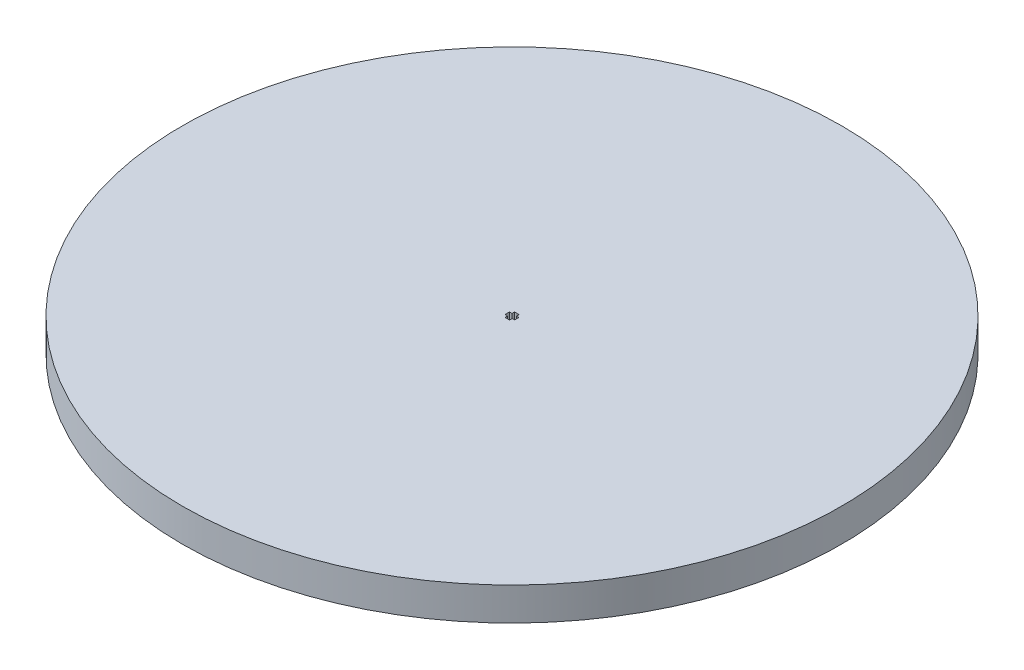
ISO-10303-21;
HEADER;
FILE_DESCRIPTION(('STEP AP214'),'2;1');
FILE_NAME('part.step','',(''),(''),'','','');
FILE_SCHEMA(('AUTOMOTIVE_DESIGN { 1 0 10303 214 1 1 1 1 }'));
ENDSEC;
DATA;
#1=APPLICATION_CONTEXT('core data for automotive mechanical design processes');
#2=APPLICATION_PROTOCOL_DEFINITION('international standard','automotive_design',2000,#1);
#3=PRODUCT_CONTEXT('',#1,'mechanical');
#4=PRODUCT('Part','Part','',(#3));
#5=PRODUCT_RELATED_PRODUCT_CATEGORY('part','',(#4));
#6=PRODUCT_DEFINITION_FORMATION('','',#4);
#7=PRODUCT_DEFINITION_CONTEXT('part definition',#1,'design');
#8=PRODUCT_DEFINITION('design','',#6,#7);
#9=PRODUCT_DEFINITION_SHAPE('','',#8);
#10=(LENGTH_UNIT() NAMED_UNIT(*) SI_UNIT(.MILLI.,.METRE.));
#11=(NAMED_UNIT(*) PLANE_ANGLE_UNIT() SI_UNIT($,.RADIAN.));
#12=(NAMED_UNIT(*) SI_UNIT($,.STERADIAN.) SOLID_ANGLE_UNIT());
#13=UNCERTAINTY_MEASURE_WITH_UNIT(LENGTH_MEASURE(1.E-05),#10,'distance_accuracy_value','');
#14=(GEOMETRIC_REPRESENTATION_CONTEXT(3) GLOBAL_UNCERTAINTY_ASSIGNED_CONTEXT((#13)) GLOBAL_UNIT_ASSIGNED_CONTEXT((#10,
#11,#12)) REPRESENTATION_CONTEXT('',''));
#15=CARTESIAN_POINT('',(0.,0.,0.));
#16=DIRECTION('',(0.,0.,1.));
#17=DIRECTION('',(1.,0.,0.));
#18=AXIS2_PLACEMENT_3D('',#15,#16,#17);
#19=CARTESIAN_POINT('',(0.0113900111349613,5.,0.337884099115303));
#20=DIRECTION('',(-0.0336906801634146,0.,-0.999432307897902));
#21=DIRECTION('',(-0.999432307897902,0.,0.0336906801634146));
#22=AXIS2_PLACEMENT_3D('',#19,#20,#21);
#23=PLANE('',#22);
#24=DIRECTION('',(0.999432307897902,0.,-0.0336906801634146));
#25=VECTOR('',#24,1.);
#26=CARTESIAN_POINT('',(0.0113900111349613,0.,0.337884099115303));
#27=LINE('',#26,#25);
#28=CARTESIAN_POINT('',(0.349274110250247,0.,0.326494087980342));
#29=VERTEX_POINT('',#28);
#30=CARTESIAN_POINT('',(0.732860344614081,0.,0.313563466231459));
#31=VERTEX_POINT('',#30);
#32=EDGE_CURVE('E175',#29,#31,#27,.T.);
#33=ORIENTED_EDGE('',*,*,#32,.F.);
#34=DIRECTION('',(0.,-1.,0.));
#35=VECTOR('',#34,1.);
#36=CARTESIAN_POINT('',(0.349274110250247,5.,0.326494087980342));
#37=LINE('',#36,#35);
#38=CARTESIAN_POINT('',(0.349274110250247,5.,0.326494087980342));
#39=VERTEX_POINT('',#38);
#40=EDGE_CURVE('E11',#39,#29,#37,.T.);
#41=ORIENTED_EDGE('',*,*,#40,.F.);
#42=DIRECTION('',(0.999432307897902,0.,-0.0336906801634146));
#43=VECTOR('',#42,1.);
#44=CARTESIAN_POINT('',(0.0113900111349613,5.,0.337884099115303));
#45=LINE('',#44,#43);
#46=CARTESIAN_POINT('',(0.732860344614081,5.,0.313563466231459));
#47=VERTEX_POINT('',#46);
#48=EDGE_CURVE('E214',#39,#47,#45,.T.);
#49=ORIENTED_EDGE('',*,*,#48,.T.);
#50=DIRECTION('',(0.,-1.,0.));
#51=VECTOR('',#50,1.);
#52=CARTESIAN_POINT('',(0.732860344614081,5.,0.313563466231459));
#53=LINE('',#52,#51);
#54=EDGE_CURVE('E51',#47,#31,#53,.T.);
#55=ORIENTED_EDGE('',*,*,#54,.T.);
#56=EDGE_LOOP('',(#33,#41,#49,#55));
#57=FACE_BOUND('',#56,.T.);
#58=ADVANCED_FACE('F35',(#57),#23,.T.);
#59=CARTESIAN_POINT('',(0.337884099115299,5.,-0.0113900111349488));
#60=DIRECTION('',(0.999432307897903,0.,-0.033690680163378));
#61=DIRECTION('',(-0.033690680163378,0.,-0.999432307897903));
#62=AXIS2_PLACEMENT_3D('',#59,#60,#61);
#63=PLANE('',#62);
#64=DIRECTION('',(0.033690680163378,0.,0.999432307897903));
#65=VECTOR('',#64,1.);
#66=CARTESIAN_POINT('',(0.337884099115299,0.,-0.0113900111349488));
#67=LINE('',#66,#65);
#68=CARTESIAN_POINT('',(0.362204731999116,0.,0.710080322344181));
#69=VERTEX_POINT('',#68);
#70=EDGE_CURVE('E177',#29,#69,#67,.T.);
#71=ORIENTED_EDGE('',*,*,#70,.T.);
#72=DIRECTION('',(0.,-1.,0.));
#73=VECTOR('',#72,1.);
#74=CARTESIAN_POINT('',(0.362204731999116,5.,0.710080322344181));
#75=LINE('',#74,#73);
#76=CARTESIAN_POINT('',(0.362204731999116,5.,0.710080322344181));
#77=VERTEX_POINT('',#76);
#78=EDGE_CURVE('E43',#77,#69,#75,.T.);
#79=ORIENTED_EDGE('',*,*,#78,.F.);
#80=DIRECTION('',(0.033690680163378,0.,0.999432307897903));
#81=VECTOR('',#80,1.);
#82=CARTESIAN_POINT('',(0.337884099115299,5.,-0.0113900111349488));
#83=LINE('',#82,#81);
#84=EDGE_CURVE('E265',#39,#77,#83,.T.);
#85=ORIENTED_EDGE('',*,*,#84,.F.);
#86=ORIENTED_EDGE('',*,*,#40,.T.);
#87=EDGE_LOOP('',(#71,#79,#85,#86));
#88=FACE_BOUND('',#87,.T.);
#89=ADVANCED_FACE('F295',(#88),#63,.F.);
#90=CARTESIAN_POINT('',(0.0243206328838019,5.,0.721470333479124));
#91=DIRECTION('',(0.0336906801633572,0.,0.999432307897904));
#92=DIRECTION('',(0.999432307897904,0.,-0.0336906801633572));
#93=AXIS2_PLACEMENT_3D('',#90,#91,#92);
#94=PLANE('',#93);
#95=DIRECTION('',(-0.999432307897904,0.,0.0336906801633572));
#96=VECTOR('',#95,1.);
#97=CARTESIAN_POINT('',(0.0243206328838019,0.,0.721470333479124));
#98=LINE('',#97,#96);
#99=CARTESIAN_POINT('',(0.0121637690797267,0.,0.721880139132769));
#100=VERTEX_POINT('',#99);
#101=EDGE_CURVE('E179',#69,#100,#98,.T.);
#102=ORIENTED_EDGE('',*,*,#101,.T.);
#103=DIRECTION('',(0.,-1.,0.));
#104=VECTOR('',#103,1.);
#105=CARTESIAN_POINT('',(0.0121637690797267,5.,0.721880139132769));
#106=LINE('',#105,#104);
#107=CARTESIAN_POINT('',(0.0121637690797267,5.,0.721880139132769));
#108=VERTEX_POINT('',#107);
#109=EDGE_CURVE('E237',#108,#100,#106,.T.);
#110=ORIENTED_EDGE('',*,*,#109,.F.);
#111=DIRECTION('',(-0.999432307897904,0.,0.0336906801633572));
#112=VECTOR('',#111,1.);
#113=CARTESIAN_POINT('',(0.0243206328838019,5.,0.721470333479124));
#114=LINE('',#113,#112);
#115=EDGE_CURVE('E245',#77,#108,#114,.T.);
#116=ORIENTED_EDGE('',*,*,#115,.F.);
#117=ORIENTED_EDGE('',*,*,#78,.T.);
#118=EDGE_LOOP('',(#102,#110,#116,#117));
#119=FACE_BOUND('',#118,.T.);
#120=ADVANCED_FACE('F243',(#119),#94,.F.);
#121=CARTESIAN_POINT('',(0.,5.,0.721880139132769));
#122=DIRECTION('',(0.,0.,-1.));
#123=DIRECTION('',(-1.,0.,0.));
#124=AXIS2_PLACEMENT_3D('',#121,#122,#123);
#125=PLANE('',#124);
#126=DIRECTION('',(1.,0.,0.));
#127=VECTOR('',#126,1.);
#128=CARTESIAN_POINT('',(0.,0.,0.721880139132769));
#129=LINE('',#128,#127);
#130=CARTESIAN_POINT('',(-0.338076022203014,0.,0.721880139132769));
#131=VERTEX_POINT('',#130);
#132=EDGE_CURVE('E182',#131,#100,#129,.T.);
#133=ORIENTED_EDGE('',*,*,#132,.F.);
#134=DIRECTION('',(0.,-1.,0.));
#135=VECTOR('',#134,1.);
#136=CARTESIAN_POINT('',(-0.338076022203014,5.,0.721880139132769));
#137=LINE('',#136,#135);
#138=CARTESIAN_POINT('',(-0.338076022203014,5.,0.721880139132769));
#139=VERTEX_POINT('',#138);
#140=EDGE_CURVE('E235',#139,#131,#137,.T.);
#141=ORIENTED_EDGE('',*,*,#140,.F.);
#142=DIRECTION('',(1.,0.,0.));
#143=VECTOR('',#142,1.);
#144=CARTESIAN_POINT('',(0.,5.,0.721880139132769));
#145=LINE('',#144,#143);
#146=EDGE_CURVE('E259',#139,#108,#145,.T.);
#147=ORIENTED_EDGE('',*,*,#146,.T.);
#148=ORIENTED_EDGE('',*,*,#109,.T.);
#149=EDGE_LOOP('',(#133,#141,#147,#148));
#150=FACE_BOUND('',#149,.T.);
#151=ADVANCED_FACE('F255',(#150),#125,.T.);
#152=CARTESIAN_POINT('',(-0.338076022203014,5.,0.));
#153=DIRECTION('',(-1.,0.,0.));
#154=DIRECTION('',(0.,0.,1.));
#155=AXIS2_PLACEMENT_3D('',#152,#153,#154);
#156=PLANE('',#155);
#157=DIRECTION('',(0.,0.,-1.));
#158=VECTOR('',#157,1.);
#159=CARTESIAN_POINT('',(-0.338076022203014,0.,0.));
#160=LINE('',#159,#158);
#161=CARTESIAN_POINT('',(-0.338076022203014,0.,0.338076022203007));
#162=VERTEX_POINT('',#161);
#163=EDGE_CURVE('E185',#131,#162,#160,.T.);
#164=ORIENTED_EDGE('',*,*,#163,.T.);
#165=DIRECTION('',(0.,-1.,0.));
#166=VECTOR('',#165,1.);
#167=CARTESIAN_POINT('',(-0.338076022203014,5.,0.338076022203007));
#168=LINE('',#167,#166);
#169=CARTESIAN_POINT('',(-0.338076022203014,5.,0.338076022203007));
#170=VERTEX_POINT('',#169);
#171=EDGE_CURVE('E232',#170,#162,#168,.T.);
#172=ORIENTED_EDGE('',*,*,#171,.F.);
#173=DIRECTION('',(0.,0.,-1.));
#174=VECTOR('',#173,1.);
#175=CARTESIAN_POINT('',(-0.338076022203014,5.,0.));
#176=LINE('',#175,#174);
#177=EDGE_CURVE('E260',#139,#170,#176,.T.);
#178=ORIENTED_EDGE('',*,*,#177,.F.);
#179=ORIENTED_EDGE('',*,*,#140,.T.);
#180=EDGE_LOOP('',(#164,#172,#178,#179));
#181=FACE_BOUND('',#180,.T.);
#182=ADVANCED_FACE('F306',(#181),#156,.F.);
#183=CARTESIAN_POINT('',(0.,5.,0.338076022203017));
#184=DIRECTION('',(0.,0.,1.));
#185=DIRECTION('',(1.,0.,0.));
#186=AXIS2_PLACEMENT_3D('',#183,#184,#185);
#187=PLANE('',#186);
#188=DIRECTION('',(-1.,0.,0.));
#189=VECTOR('',#188,1.);
#190=CARTESIAN_POINT('',(0.,0.,0.338076022203017));
#191=LINE('',#190,#189);
#192=CARTESIAN_POINT('',(-0.72188013913278,0.,0.338076022202996));
#193=VERTEX_POINT('',#192);
#194=EDGE_CURVE('E187',#162,#193,#191,.T.);
#195=ORIENTED_EDGE('',*,*,#194,.T.);
#196=DIRECTION('',(0.,-1.,0.));
#197=VECTOR('',#196,1.);
#198=CARTESIAN_POINT('',(-0.72188013913278,5.,0.338076022202996));
#199=LINE('',#198,#197);
#200=CARTESIAN_POINT('',(-0.72188013913278,5.,0.338076022202996));
#201=VERTEX_POINT('',#200);
#202=EDGE_CURVE('E229',#201,#193,#199,.T.);
#203=ORIENTED_EDGE('',*,*,#202,.F.);
#204=DIRECTION('',(-1.,0.,0.));
#205=VECTOR('',#204,1.);
#206=CARTESIAN_POINT('',(0.,5.,0.338076022203017));
#207=LINE('',#206,#205);
#208=EDGE_CURVE('E262',#170,#201,#207,.T.);
#209=ORIENTED_EDGE('',*,*,#208,.F.);
#210=ORIENTED_EDGE('',*,*,#171,.T.);
#211=EDGE_LOOP('',(#195,#203,#209,#210));
#212=FACE_BOUND('',#211,.T.);
#213=ADVANCED_FACE('F307',(#212),#187,.F.);
#214=CARTESIAN_POINT('',(-0.721880139132775,5.,0.));
#215=DIRECTION('',(-1.,0.,0.));
#216=DIRECTION('',(0.,0.,1.));
#217=AXIS2_PLACEMENT_3D('',#214,#215,#216);
#218=PLANE('',#217);
#219=DIRECTION('',(0.,0.,-1.));
#220=VECTOR('',#219,1.);
#221=CARTESIAN_POINT('',(-0.721880139132775,0.,0.));
#222=LINE('',#221,#220);
#223=CARTESIAN_POINT('',(-0.72188013913278,0.,-0.338076022202996));
#224=VERTEX_POINT('',#223);
#225=EDGE_CURVE('E190',#193,#224,#222,.T.);
#226=ORIENTED_EDGE('',*,*,#225,.T.);
#227=DIRECTION('',(0.,-1.,0.));
#228=VECTOR('',#227,1.);
#229=CARTESIAN_POINT('',(-0.72188013913278,5.,-0.338076022202996));
#230=LINE('',#229,#228);
#231=CARTESIAN_POINT('',(-0.72188013913278,5.,-0.338076022202996));
#232=VERTEX_POINT('',#231);
#233=EDGE_CURVE('E227',#232,#224,#230,.T.);
#234=ORIENTED_EDGE('',*,*,#233,.F.);
#235=DIRECTION('',(0.,0.,-1.));
#236=VECTOR('',#235,1.);
#237=CARTESIAN_POINT('',(-0.721880139132775,5.,0.));
#238=LINE('',#237,#236);
#239=EDGE_CURVE('E270',#201,#232,#238,.T.);
#240=ORIENTED_EDGE('',*,*,#239,.F.);
#241=ORIENTED_EDGE('',*,*,#202,.T.);
#242=EDGE_LOOP('',(#226,#234,#240,#241));
#243=FACE_BOUND('',#242,.T.);
#244=ADVANCED_FACE('F310',(#243),#218,.F.);
#245=CARTESIAN_POINT('',(0.,5.,-0.338076022203017));
#246=DIRECTION('',(0.,0.,1.));
#247=DIRECTION('',(1.,0.,0.));
#248=AXIS2_PLACEMENT_3D('',#245,#246,#247);
#249=PLANE('',#248);
#250=DIRECTION('',(-1.,0.,0.));
#251=VECTOR('',#250,1.);
#252=CARTESIAN_POINT('',(0.,0.,-0.338076022203017));
#253=LINE('',#252,#251);
#254=CARTESIAN_POINT('',(-0.338076022203014,0.,-0.338076022203007));
#255=VERTEX_POINT('',#254);
#256=EDGE_CURVE('E193',#255,#224,#253,.T.);
#257=ORIENTED_EDGE('',*,*,#256,.F.);
#258=DIRECTION('',(0.,-1.,0.));
#259=VECTOR('',#258,1.);
#260=CARTESIAN_POINT('',(-0.338076022203014,5.,-0.338076022203007));
#261=LINE('',#260,#259);
#262=CARTESIAN_POINT('',(-0.338076022203014,5.,-0.338076022203007));
#263=VERTEX_POINT('',#262);
#264=EDGE_CURVE('E225',#263,#255,#261,.T.);
#265=ORIENTED_EDGE('',*,*,#264,.F.);
#266=DIRECTION('',(-1.,0.,0.));
#267=VECTOR('',#266,1.);
#268=CARTESIAN_POINT('',(0.,5.,-0.338076022203017));
#269=LINE('',#268,#267);
#270=EDGE_CURVE('E272',#263,#232,#269,.T.);
#271=ORIENTED_EDGE('',*,*,#270,.T.);
#272=ORIENTED_EDGE('',*,*,#233,.T.);
#273=EDGE_LOOP('',(#257,#265,#271,#272));
#274=FACE_BOUND('',#273,.T.);
#275=ADVANCED_FACE('F314',(#274),#249,.T.);
#276=CARTESIAN_POINT('',(-0.338076022203014,0.,-0.721880139132769));
#277=VERTEX_POINT('',#276);
#278=EDGE_CURVE('E188',#255,#277,#160,.T.);
#279=ORIENTED_EDGE('',*,*,#278,.T.);
#280=DIRECTION('',(0.,-1.,0.));
#281=VECTOR('',#280,1.);
#282=CARTESIAN_POINT('',(-0.338076022203014,5.,-0.721880139132769));
#283=LINE('',#282,#281);
#284=CARTESIAN_POINT('',(-0.338076022203014,5.,-0.721880139132769));
#285=VERTEX_POINT('',#284);
#286=EDGE_CURVE('E222',#285,#277,#283,.T.);
#287=ORIENTED_EDGE('',*,*,#286,.F.);
#288=EDGE_CURVE('E264',#263,#285,#176,.T.);
#289=ORIENTED_EDGE('',*,*,#288,.F.);
#290=ORIENTED_EDGE('',*,*,#264,.T.);
#291=EDGE_LOOP('',(#279,#287,#289,#290));
#292=FACE_BOUND('',#291,.T.);
#293=ADVANCED_FACE('F318',(#292),#156,.F.);
#294=CARTESIAN_POINT('',(0.,5.,-0.721880139132769));
#295=DIRECTION('',(0.,0.,-1.));
#296=DIRECTION('',(-1.,0.,0.));
#297=AXIS2_PLACEMENT_3D('',#294,#295,#296);
#298=PLANE('',#297);
#299=DIRECTION('',(1.,0.,0.));
#300=VECTOR('',#299,1.);
#301=CARTESIAN_POINT('',(0.,0.,-0.721880139132769));
#302=LINE('',#301,#300);
#303=CARTESIAN_POINT('',(0.0121637690797267,0.,-0.721880139132769));
#304=VERTEX_POINT('',#303);
#305=EDGE_CURVE('E196',#277,#304,#302,.T.);
#306=ORIENTED_EDGE('',*,*,#305,.T.);
#307=DIRECTION('',(0.,-1.,0.));
#308=VECTOR('',#307,1.);
#309=CARTESIAN_POINT('',(0.0121637690797267,5.,-0.721880139132769));
#310=LINE('',#309,#308);
#311=CARTESIAN_POINT('',(0.0121637690797267,5.,-0.721880139132769));
#312=VERTEX_POINT('',#311);
#313=EDGE_CURVE('E220',#312,#304,#310,.T.);
#314=ORIENTED_EDGE('',*,*,#313,.F.);
#315=DIRECTION('',(1.,0.,0.));
#316=VECTOR('',#315,1.);
#317=CARTESIAN_POINT('',(0.,5.,-0.721880139132769));
#318=LINE('',#317,#316);
#319=EDGE_CURVE('E275',#285,#312,#318,.T.);
#320=ORIENTED_EDGE('',*,*,#319,.F.);
#321=ORIENTED_EDGE('',*,*,#286,.T.);
#322=EDGE_LOOP('',(#306,#314,#320,#321));
#323=FACE_BOUND('',#322,.T.);
#324=ADVANCED_FACE('F322',(#323),#298,.F.);
#325=CARTESIAN_POINT('',(0.0243206328838019,5.,-0.721470333479124));
#326=DIRECTION('',(-0.0336906801633572,0.,0.999432307897904));
#327=DIRECTION('',(0.999432307897904,0.,0.0336906801633572));
#328=AXIS2_PLACEMENT_3D('',#325,#326,#327);
#329=PLANE('',#328);
#330=DIRECTION('',(-0.999432307897904,0.,-0.0336906801633572));
#331=VECTOR('',#330,1.);
#332=CARTESIAN_POINT('',(0.0243206328838019,0.,-0.721470333479124));
#333=LINE('',#332,#331);
#334=CARTESIAN_POINT('',(0.362204731999116,0.,-0.710080322344181));
#335=VERTEX_POINT('',#334);
#336=EDGE_CURVE('E199',#335,#304,#333,.T.);
#337=ORIENTED_EDGE('',*,*,#336,.F.);
#338=DIRECTION('',(0.,-1.,0.));
#339=VECTOR('',#338,1.);
#340=CARTESIAN_POINT('',(0.362204731999116,5.,-0.710080322344181));
#341=LINE('',#340,#339);
#342=CARTESIAN_POINT('',(0.362204731999116,5.,-0.710080322344181));
#343=VERTEX_POINT('',#342);
#344=EDGE_CURVE('E218',#343,#335,#341,.T.);
#345=ORIENTED_EDGE('',*,*,#344,.F.);
#346=DIRECTION('',(-0.999432307897904,0.,-0.0336906801633572));
#347=VECTOR('',#346,1.);
#348=CARTESIAN_POINT('',(0.0243206328838019,5.,-0.721470333479124));
#349=LINE('',#348,#347);
#350=EDGE_CURVE('E277',#343,#312,#349,.T.);
#351=ORIENTED_EDGE('',*,*,#350,.T.);
#352=ORIENTED_EDGE('',*,*,#313,.T.);
#353=EDGE_LOOP('',(#337,#345,#351,#352));
#354=FACE_BOUND('',#353,.T.);
#355=ADVANCED_FACE('F326',(#354),#329,.T.);
#356=CARTESIAN_POINT('',(0.337884099115299,5.,0.0113900111349488));
#357=DIRECTION('',(-0.999432307897903,0.,-0.033690680163378));
#358=DIRECTION('',(-0.033690680163378,0.,0.999432307897903));
#359=AXIS2_PLACEMENT_3D('',#356,#357,#358);
#360=PLANE('',#359);
#361=DIRECTION('',(0.033690680163378,0.,-0.999432307897903));
#362=VECTOR('',#361,1.);
#363=CARTESIAN_POINT('',(0.337884099115299,0.,0.0113900111349488));
#364=LINE('',#363,#362);
#365=CARTESIAN_POINT('',(0.349274110250247,0.,-0.326494087980342));
#366=VERTEX_POINT('',#365);
#367=EDGE_CURVE('E202',#366,#335,#364,.T.);
#368=ORIENTED_EDGE('',*,*,#367,.F.);
#369=DIRECTION('',(0.,-1.,0.));
#370=VECTOR('',#369,1.);
#371=CARTESIAN_POINT('',(0.349274110250247,5.,-0.326494087980342));
#372=LINE('',#371,#370);
#373=CARTESIAN_POINT('',(0.349274110250247,5.,-0.326494087980342));
#374=VERTEX_POINT('',#373);
#375=EDGE_CURVE('E164',#374,#366,#372,.T.);
#376=ORIENTED_EDGE('',*,*,#375,.F.);
#377=DIRECTION('',(0.033690680163378,0.,-0.999432307897903));
#378=VECTOR('',#377,1.);
#379=CARTESIAN_POINT('',(0.337884099115299,5.,0.0113900111349488));
#380=LINE('',#379,#378);
#381=EDGE_CURVE('E154',#374,#343,#380,.T.);
#382=ORIENTED_EDGE('',*,*,#381,.T.);
#383=ORIENTED_EDGE('',*,*,#344,.T.);
#384=EDGE_LOOP('',(#368,#376,#382,#383));
#385=FACE_BOUND('',#384,.T.);
#386=ADVANCED_FACE('F281',(#385),#360,.T.);
#387=CARTESIAN_POINT('',(0.0113900111349613,5.,-0.337884099115303));
#388=DIRECTION('',(0.0336906801634146,0.,-0.999432307897902));
#389=DIRECTION('',(-0.999432307897902,0.,-0.0336906801634146));
#390=AXIS2_PLACEMENT_3D('',#387,#388,#389);
#391=PLANE('',#390);
#392=DIRECTION('',(0.999432307897902,0.,0.0336906801634146));
#393=VECTOR('',#392,1.);
#394=CARTESIAN_POINT('',(0.0113900111349613,0.,-0.337884099115303));
#395=LINE('',#394,#393);
#396=CARTESIAN_POINT('',(0.732860344614081,0.,-0.313563466231459));
#397=VERTEX_POINT('',#396);
#398=EDGE_CURVE('E161',#366,#397,#395,.T.);
#399=ORIENTED_EDGE('',*,*,#398,.T.);
#400=DIRECTION('',(0.,-1.,0.));
#401=VECTOR('',#400,1.);
#402=CARTESIAN_POINT('',(0.732860344614081,5.,-0.313563466231459));
#403=LINE('',#402,#401);
#404=CARTESIAN_POINT('',(0.732860344614081,5.,-0.313563466231459));
#405=VERTEX_POINT('',#404);
#406=EDGE_CURVE('E158',#405,#397,#403,.T.);
#407=ORIENTED_EDGE('',*,*,#406,.F.);
#408=DIRECTION('',(0.999432307897902,0.,0.0336906801634146));
#409=VECTOR('',#408,1.);
#410=CARTESIAN_POINT('',(0.0113900111349613,5.,-0.337884099115303));
#411=LINE('',#410,#409);
#412=EDGE_CURVE('E144',#374,#405,#411,.T.);
#413=ORIENTED_EDGE('',*,*,#412,.F.);
#414=ORIENTED_EDGE('',*,*,#375,.T.);
#415=EDGE_LOOP('',(#399,#407,#413,#414));
#416=FACE_BOUND('',#415,.T.);
#417=ADVANCED_FACE('F159',(#416),#391,.F.);
#418=CARTESIAN_POINT('',(0.721470333479129,5.,0.0243206328838245));
#419=DIRECTION('',(0.999432307897903,0.,0.0336906801633881));
#420=DIRECTION('',(0.0336906801633881,0.,-0.999432307897903));
#421=AXIS2_PLACEMENT_3D('',#418,#419,#420);
#422=PLANE('',#421);
#423=DIRECTION('',(-0.0336906801633881,0.,0.999432307897903));
#424=VECTOR('',#423,1.);
#425=CARTESIAN_POINT('',(0.721470333479129,0.,0.0243206328838245));
#426=LINE('',#425,#424);
#427=CARTESIAN_POINT('',(0.722290177562,0.,0.));
#428=VERTEX_POINT('',#427);
#429=EDGE_CURVE('E206',#397,#428,#426,.T.);
#430=ORIENTED_EDGE('',*,*,#429,.T.);
#431=DIRECTION('',(0.,-1.,0.));
#432=VECTOR('',#431,1.);
#433=CARTESIAN_POINT('',(0.722290177562,5.,0.));
#434=LINE('',#433,#432);
#435=CARTESIAN_POINT('',(0.722290177562,5.,0.));
#436=VERTEX_POINT('',#435);
#437=EDGE_CURVE('E98',#436,#428,#434,.T.);
#438=ORIENTED_EDGE('',*,*,#437,.F.);
#439=DIRECTION('',(-0.0336906801633881,0.,0.999432307897903));
#440=VECTOR('',#439,1.);
#441=CARTESIAN_POINT('',(0.721470333479129,5.,0.0243206328838245));
#442=LINE('',#441,#440);
#443=EDGE_CURVE('E151',#405,#436,#442,.T.);
#444=ORIENTED_EDGE('',*,*,#443,.F.);
#445=ORIENTED_EDGE('',*,*,#406,.T.);
#446=EDGE_LOOP('',(#430,#438,#444,#445));
#447=FACE_BOUND('',#446,.T.);
#448=ADVANCED_FACE('F166',(#447),#422,.F.);
#449=CARTESIAN_POINT('',(0.721470333479129,5.,-0.0243206328838245));
#450=DIRECTION('',(-0.999432307897903,0.,0.0336906801633881));
#451=DIRECTION('',(0.0336906801633881,0.,0.999432307897903));
#452=AXIS2_PLACEMENT_3D('',#449,#450,#451);
#453=PLANE('',#452);
#454=DIRECTION('',(-0.0336906801633881,0.,-0.999432307897903));
#455=VECTOR('',#454,1.);
#456=CARTESIAN_POINT('',(0.721470333479129,0.,-0.0243206328838245));
#457=LINE('',#456,#455);
#458=EDGE_CURVE('E208',#31,#428,#457,.T.);
#459=ORIENTED_EDGE('',*,*,#458,.F.);
#460=ORIENTED_EDGE('',*,*,#54,.F.);
#461=DIRECTION('',(-0.0336906801633881,0.,-0.999432307897903));
#462=VECTOR('',#461,1.);
#463=CARTESIAN_POINT('',(0.721470333479129,5.,-0.0243206328838245));
#464=LINE('',#463,#462);
#465=EDGE_CURVE('E167',#47,#436,#464,.T.);
#466=ORIENTED_EDGE('',*,*,#465,.T.);
#467=ORIENTED_EDGE('',*,*,#437,.T.);
#468=EDGE_LOOP('',(#459,#460,#466,#467));
#469=FACE_BOUND('',#468,.T.);
#470=ADVANCED_FACE('F283',(#469),#453,.T.);
#471=CARTESIAN_POINT('',(0.,5.,0.));
#472=DIRECTION('',(0.,-1.,0.));
#473=DIRECTION('',(0.,0.,-1.));
#474=AXIS2_PLACEMENT_3D('',#471,#472,#473);
#475=CYLINDRICAL_SURFACE('',#474,50.);
#476=CARTESIAN_POINT('',(0.,5.,0.));
#477=DIRECTION('',(0.,1.,0.));
#478=DIRECTION('',(0.,0.,1.));
#479=AXIS2_PLACEMENT_3D('',#476,#477,#478);
#480=CIRCLE('',#479,50.);
#481=CARTESIAN_POINT('',(0.,5.,50.));
#482=VERTEX_POINT('',#481);
#483=EDGE_CURVE('E169',#482,#482,#480,.T.);
#484=ORIENTED_EDGE('',*,*,#483,.F.);
#485=EDGE_LOOP('',(#484));
#486=FACE_BOUND('',#485,.T.);
#487=CARTESIAN_POINT('',(0.,0.,0.));
#488=DIRECTION('',(0.,1.,0.));
#489=DIRECTION('',(0.,0.,1.));
#490=AXIS2_PLACEMENT_3D('',#487,#488,#489);
#491=CIRCLE('',#490,50.);
#492=CARTESIAN_POINT('',(0.,0.,50.));
#493=VERTEX_POINT('',#492);
#494=EDGE_CURVE('E211',#493,#493,#491,.T.);
#495=ORIENTED_EDGE('',*,*,#494,.T.);
#496=EDGE_LOOP('',(#495));
#497=FACE_BOUND('',#496,.T.);
#498=ADVANCED_FACE('F285',(#486,#497),#475,.T.);
#499=CARTESIAN_POINT('',(0.,5.,0.));
#500=DIRECTION('',(0.,1.,0.));
#501=DIRECTION('',(0.,0.,1.));
#502=AXIS2_PLACEMENT_3D('',#499,#500,#501);
#503=PLANE('',#502);
#504=ORIENTED_EDGE('',*,*,#48,.F.);
#505=ORIENTED_EDGE('',*,*,#84,.T.);
#506=ORIENTED_EDGE('',*,*,#115,.T.);
#507=ORIENTED_EDGE('',*,*,#146,.F.);
#508=ORIENTED_EDGE('',*,*,#177,.T.);
#509=ORIENTED_EDGE('',*,*,#208,.T.);
#510=ORIENTED_EDGE('',*,*,#239,.T.);
#511=ORIENTED_EDGE('',*,*,#270,.F.);
#512=ORIENTED_EDGE('',*,*,#288,.T.);
#513=ORIENTED_EDGE('',*,*,#319,.T.);
#514=ORIENTED_EDGE('',*,*,#350,.F.);
#515=ORIENTED_EDGE('',*,*,#381,.F.);
#516=ORIENTED_EDGE('',*,*,#412,.T.);
#517=ORIENTED_EDGE('',*,*,#443,.T.);
#518=ORIENTED_EDGE('',*,*,#465,.F.);
#519=EDGE_LOOP('',(#504,#505,#506,#507,#508,#509,#510,#511,#512,#513,#514,#515,#516,#517,#518));
#520=FACE_BOUND('',#519,.T.);
#521=ORIENTED_EDGE('',*,*,#483,.T.);
#522=EDGE_LOOP('',(#521));
#523=FACE_BOUND('',#522,.T.);
#524=ADVANCED_FACE('F147',(#520,#523),#503,.T.);
#525=CARTESIAN_POINT('',(0.,0.,0.));
#526=DIRECTION('',(0.,1.,0.));
#527=DIRECTION('',(0.,0.,1.));
#528=AXIS2_PLACEMENT_3D('',#525,#526,#527);
#529=PLANE('',#528);
#530=ORIENTED_EDGE('',*,*,#32,.T.);
#531=ORIENTED_EDGE('',*,*,#458,.T.);
#532=ORIENTED_EDGE('',*,*,#429,.F.);
#533=ORIENTED_EDGE('',*,*,#398,.F.);
#534=ORIENTED_EDGE('',*,*,#367,.T.);
#535=ORIENTED_EDGE('',*,*,#336,.T.);
#536=ORIENTED_EDGE('',*,*,#305,.F.);
#537=ORIENTED_EDGE('',*,*,#278,.F.);
#538=ORIENTED_EDGE('',*,*,#256,.T.);
#539=ORIENTED_EDGE('',*,*,#225,.F.);
#540=ORIENTED_EDGE('',*,*,#194,.F.);
#541=ORIENTED_EDGE('',*,*,#163,.F.);
#542=ORIENTED_EDGE('',*,*,#132,.T.);
#543=ORIENTED_EDGE('',*,*,#101,.F.);
#544=ORIENTED_EDGE('',*,*,#70,.F.);
#545=EDGE_LOOP('',(#530,#531,#532,#533,#534,#535,#536,#537,#538,#539,#540,#541,#542,#543,#544));
#546=FACE_BOUND('',#545,.T.);
#547=ORIENTED_EDGE('',*,*,#494,.F.);
#548=EDGE_LOOP('',(#547));
#549=FACE_BOUND('',#548,.T.);
#550=ADVANCED_FACE('F249',(#546,#549),#529,.F.);
#551=CLOSED_SHELL('',(#58,#89,#120,#151,#182,#213,#244,#275,#293,#324,#355,#386,#417,#448,#470,
#498,#524,#550));
#552=MANIFOLD_SOLID_BREP('B2',#551);
#553=ADVANCED_BREP_SHAPE_REPRESENTATION('',(#18,#552),#14);
#554=SHAPE_DEFINITION_REPRESENTATION(#9,#553);
ENDSEC;
END-ISO-10303-21;
